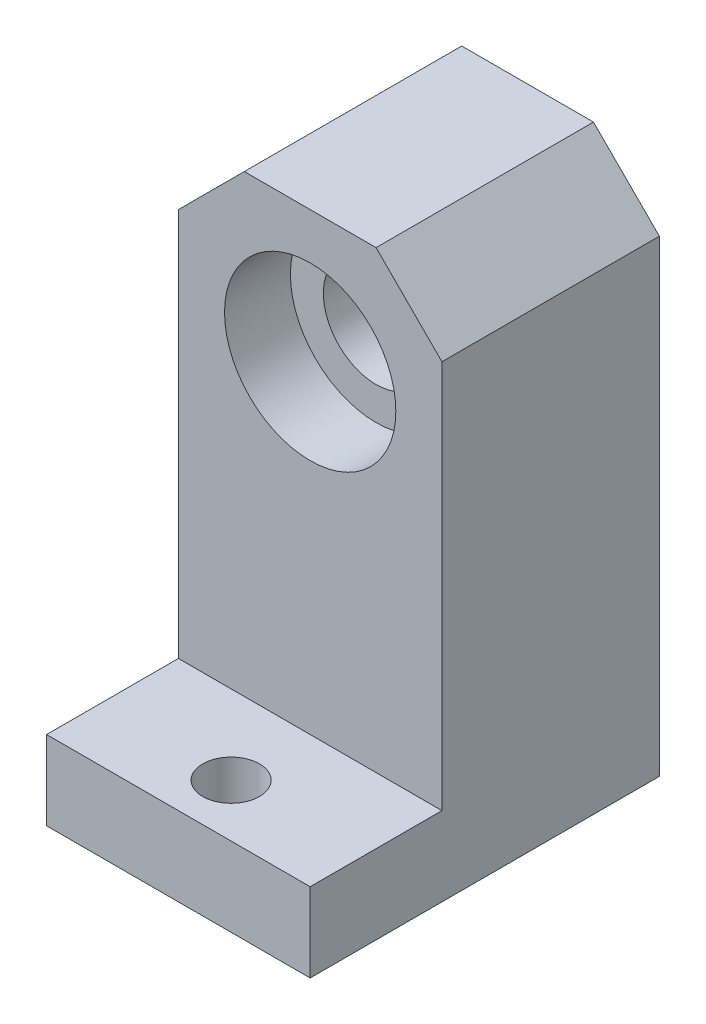
ISO-10303-21;
HEADER;
FILE_DESCRIPTION(('STEP AP214'),'2;1');
FILE_NAME('part.step','',(''),(''),'','','');
FILE_SCHEMA(('AUTOMOTIVE_DESIGN { 1 0 10303 214 1 1 1 1 }'));
ENDSEC;
DATA;
#1=APPLICATION_CONTEXT('core data for automotive mechanical design processes');
#2=APPLICATION_PROTOCOL_DEFINITION('international standard','automotive_design',2000,#1);
#3=PRODUCT_CONTEXT('',#1,'mechanical');
#4=PRODUCT('Part','Part','',(#3));
#5=PRODUCT_RELATED_PRODUCT_CATEGORY('part','',(#4));
#6=PRODUCT_DEFINITION_FORMATION('','',#4);
#7=PRODUCT_DEFINITION_CONTEXT('part definition',#1,'design');
#8=PRODUCT_DEFINITION('design','',#6,#7);
#9=PRODUCT_DEFINITION_SHAPE('','',#8);
#10=(LENGTH_UNIT() NAMED_UNIT(*) SI_UNIT(.MILLI.,.METRE.));
#11=(NAMED_UNIT(*) PLANE_ANGLE_UNIT() SI_UNIT($,.RADIAN.));
#12=(NAMED_UNIT(*) SI_UNIT($,.STERADIAN.) SOLID_ANGLE_UNIT());
#13=UNCERTAINTY_MEASURE_WITH_UNIT(LENGTH_MEASURE(1.E-05),#10,'distance_accuracy_value','');
#14=(GEOMETRIC_REPRESENTATION_CONTEXT(3) GLOBAL_UNCERTAINTY_ASSIGNED_CONTEXT((#13)) GLOBAL_UNIT_ASSIGNED_CONTEXT((#10,
#11,#12)) REPRESENTATION_CONTEXT('',''));
#15=CARTESIAN_POINT('',(0.,0.,0.));
#16=DIRECTION('',(0.,0.,1.));
#17=DIRECTION('',(1.,0.,0.));
#18=AXIS2_PLACEMENT_3D('',#15,#16,#17);
#19=CARTESIAN_POINT('',(0.,30.5,-8.25));
#20=DIRECTION('',(0.,0.,1.));
#21=DIRECTION('',(1.,0.,0.));
#22=AXIS2_PLACEMENT_3D('',#19,#20,#21);
#23=CYLINDRICAL_SURFACE('',#22,4.);
#24=CARTESIAN_POINT('',(0.,30.5,3.25));
#25=DIRECTION('',(0.,0.,1.));
#26=DIRECTION('',(1.,0.,0.));
#27=AXIS2_PLACEMENT_3D('',#24,#25,#26);
#28=CIRCLE('',#27,4.);
#29=CARTESIAN_POINT('',(4.,30.5,3.25));
#30=VERTEX_POINT('',#29);
#31=EDGE_CURVE('E137',#30,#30,#28,.F.);
#32=ORIENTED_EDGE('',*,*,#31,.F.);
#33=EDGE_LOOP('',(#32));
#34=FACE_BOUND('',#33,.T.);
#35=CARTESIAN_POINT('',(0.,30.5,-3.25));
#36=DIRECTION('',(0.,0.,-1.));
#37=DIRECTION('',(-1.,0.,0.));
#38=AXIS2_PLACEMENT_3D('',#35,#36,#37);
#39=CIRCLE('',#38,4.);
#40=CARTESIAN_POINT('',(-4.,30.5,-3.25));
#41=VERTEX_POINT('',#40);
#42=EDGE_CURVE('E150',#41,#41,#39,.F.);
#43=ORIENTED_EDGE('',*,*,#42,.F.);
#44=EDGE_LOOP('',(#43));
#45=FACE_BOUND('',#44,.T.);
#46=ADVANCED_FACE('F40',(#34,#45),#23,.F.);
#47=CARTESIAN_POINT('',(10.,0.,8.25));
#48=DIRECTION('',(-1.,0.,0.));
#49=DIRECTION('',(0.,-1.,0.));
#50=AXIS2_PLACEMENT_3D('',#47,#48,#49);
#51=PLANE('',#50);
#52=DIRECTION('',(0.,1.,0.));
#53=VECTOR('',#52,1.);
#54=CARTESIAN_POINT('',(10.,0.,-8.25));
#55=LINE('',#54,#53);
#56=CARTESIAN_POINT('',(10.,0.,-8.25));
#57=VERTEX_POINT('',#56);
#58=CARTESIAN_POINT('',(10.,35.5,-8.25));
#59=VERTEX_POINT('',#58);
#60=EDGE_CURVE('E133',#57,#59,#55,.T.);
#61=ORIENTED_EDGE('',*,*,#60,.T.);
#62=DIRECTION('',(0.,0.,1.));
#63=VECTOR('',#62,1.);
#64=CARTESIAN_POINT('',(10.,35.5,8.25));
#65=LINE('',#64,#63);
#66=CARTESIAN_POINT('',(10.,35.5,8.25));
#67=VERTEX_POINT('',#66);
#68=EDGE_CURVE('E163',#59,#67,#65,.T.);
#69=ORIENTED_EDGE('',*,*,#68,.T.);
#70=DIRECTION('',(0.,1.,0.));
#71=VECTOR('',#70,1.);
#72=CARTESIAN_POINT('',(10.,0.,8.25));
#73=LINE('',#72,#71);
#74=CARTESIAN_POINT('',(10.,6.,8.25));
#75=VERTEX_POINT('',#74);
#76=EDGE_CURVE('E129',#75,#67,#73,.T.);
#77=ORIENTED_EDGE('',*,*,#76,.F.);
#78=DIRECTION('',(0.,0.,1.));
#79=VECTOR('',#78,1.);
#80=CARTESIAN_POINT('',(10.,6.,18.25));
#81=LINE('',#80,#79);
#82=CARTESIAN_POINT('',(10.,6.,18.25));
#83=VERTEX_POINT('',#82);
#84=EDGE_CURVE('E56',#75,#83,#81,.T.);
#85=ORIENTED_EDGE('',*,*,#84,.T.);
#86=DIRECTION('',(0.,-1.,0.));
#87=VECTOR('',#86,1.);
#88=CARTESIAN_POINT('',(10.,0.,18.25));
#89=LINE('',#88,#87);
#90=CARTESIAN_POINT('',(10.,0.,18.25));
#91=VERTEX_POINT('',#90);
#92=EDGE_CURVE('E120',#83,#91,#89,.T.);
#93=ORIENTED_EDGE('',*,*,#92,.T.);
#94=DIRECTION('',(0.,0.,-1.));
#95=VECTOR('',#94,1.);
#96=CARTESIAN_POINT('',(10.,0.,8.25));
#97=LINE('',#96,#95);
#98=EDGE_CURVE('E123',#91,#57,#97,.T.);
#99=ORIENTED_EDGE('',*,*,#98,.T.);
#100=EDGE_LOOP('',(#61,#69,#77,#85,#93,#99));
#101=FACE_BOUND('',#100,.T.);
#102=ADVANCED_FACE('F181',(#101),#51,.F.);
#103=CARTESIAN_POINT('',(-10.,40.5,8.25));
#104=DIRECTION('',(0.,-1.,0.));
#105=DIRECTION('',(0.,0.,-1.));
#106=AXIS2_PLACEMENT_3D('',#103,#104,#105);
#107=PLANE('',#106);
#108=DIRECTION('',(-1.,0.,0.));
#109=VECTOR('',#108,1.);
#110=CARTESIAN_POINT('',(-10.,40.5,8.25));
#111=LINE('',#110,#109);
#112=CARTESIAN_POINT('',(5.,40.5,8.25));
#113=VERTEX_POINT('',#112);
#114=CARTESIAN_POINT('',(-4.99999999999997,40.5,8.25));
#115=VERTEX_POINT('',#114);
#116=EDGE_CURVE('E124',#113,#115,#111,.T.);
#117=ORIENTED_EDGE('',*,*,#116,.F.);
#118=DIRECTION('',(0.,0.,-1.));
#119=VECTOR('',#118,1.);
#120=CARTESIAN_POINT('',(5.,40.5,8.25));
#121=LINE('',#120,#119);
#122=CARTESIAN_POINT('',(5.,40.5,-8.25));
#123=VERTEX_POINT('',#122);
#124=EDGE_CURVE('E156',#113,#123,#121,.T.);
#125=ORIENTED_EDGE('',*,*,#124,.T.);
#126=DIRECTION('',(-1.,0.,0.));
#127=VECTOR('',#126,1.);
#128=CARTESIAN_POINT('',(-10.,40.5,-8.25));
#129=LINE('',#128,#127);
#130=CARTESIAN_POINT('',(-4.99999999999997,40.5,-8.25));
#131=VERTEX_POINT('',#130);
#132=EDGE_CURVE('E136',#123,#131,#129,.T.);
#133=ORIENTED_EDGE('',*,*,#132,.T.);
#134=DIRECTION('',(0.,0.,1.));
#135=VECTOR('',#134,1.);
#136=CARTESIAN_POINT('',(-4.99999999999997,40.5,8.25));
#137=LINE('',#136,#135);
#138=EDGE_CURVE('E146',#131,#115,#137,.T.);
#139=ORIENTED_EDGE('',*,*,#138,.T.);
#140=EDGE_LOOP('',(#117,#125,#133,#139));
#141=FACE_BOUND('',#140,.T.);
#142=ADVANCED_FACE('F172',(#141),#107,.F.);
#143=CARTESIAN_POINT('',(-10.,0.,8.25));
#144=DIRECTION('',(1.,0.,0.));
#145=DIRECTION('',(0.,1.,0.));
#146=AXIS2_PLACEMENT_3D('',#143,#144,#145);
#147=PLANE('',#146);
#148=DIRECTION('',(0.,-1.,0.));
#149=VECTOR('',#148,1.);
#150=CARTESIAN_POINT('',(-10.,0.,8.25));
#151=LINE('',#150,#149);
#152=CARTESIAN_POINT('',(-10.,35.5,8.25));
#153=VERTEX_POINT('',#152);
#154=CARTESIAN_POINT('',(-10.,6.,8.25));
#155=VERTEX_POINT('',#154);
#156=EDGE_CURVE('E117',#153,#155,#151,.T.);
#157=ORIENTED_EDGE('',*,*,#156,.F.);
#158=DIRECTION('',(0.,0.,-1.));
#159=VECTOR('',#158,1.);
#160=CARTESIAN_POINT('',(-10.,35.5,8.25));
#161=LINE('',#160,#159);
#162=CARTESIAN_POINT('',(-10.,35.5,-8.25));
#163=VERTEX_POINT('',#162);
#164=EDGE_CURVE('E11',#153,#163,#161,.T.);
#165=ORIENTED_EDGE('',*,*,#164,.T.);
#166=DIRECTION('',(0.,-1.,0.));
#167=VECTOR('',#166,1.);
#168=CARTESIAN_POINT('',(-10.,0.,-8.25));
#169=LINE('',#168,#167);
#170=CARTESIAN_POINT('',(-10.,0.,-8.25));
#171=VERTEX_POINT('',#170);
#172=EDGE_CURVE('E140',#163,#171,#169,.T.);
#173=ORIENTED_EDGE('',*,*,#172,.T.);
#174=DIRECTION('',(0.,0.,-1.));
#175=VECTOR('',#174,1.);
#176=CARTESIAN_POINT('',(-10.,0.,8.25));
#177=LINE('',#176,#175);
#178=CARTESIAN_POINT('',(-10.,0.,18.25));
#179=VERTEX_POINT('',#178);
#180=EDGE_CURVE('E127',#179,#171,#177,.T.);
#181=ORIENTED_EDGE('',*,*,#180,.F.);
#182=DIRECTION('',(0.,-1.,0.));
#183=VECTOR('',#182,1.);
#184=CARTESIAN_POINT('',(-10.,0.,18.25));
#185=LINE('',#184,#183);
#186=CARTESIAN_POINT('',(-10.,6.,18.25));
#187=VERTEX_POINT('',#186);
#188=EDGE_CURVE('E112',#187,#179,#185,.T.);
#189=ORIENTED_EDGE('',*,*,#188,.F.);
#190=DIRECTION('',(0.,0.,1.));
#191=VECTOR('',#190,1.);
#192=CARTESIAN_POINT('',(-10.,6.,18.25));
#193=LINE('',#192,#191);
#194=EDGE_CURVE('E109',#155,#187,#193,.T.);
#195=ORIENTED_EDGE('',*,*,#194,.F.);
#196=EDGE_LOOP('',(#157,#165,#173,#181,#189,#195));
#197=FACE_BOUND('',#196,.T.);
#198=ADVANCED_FACE('F116',(#197),#147,.F.);
#199=CARTESIAN_POINT('',(-10.,0.,8.25));
#200=DIRECTION('',(0.,1.,0.));
#201=DIRECTION('',(-1.,0.,0.));
#202=AXIS2_PLACEMENT_3D('',#199,#200,#201);
#203=PLANE('',#202);
#204=CARTESIAN_POINT('',(0.,0.,14.25));
#205=DIRECTION('',(0.,1.,0.));
#206=DIRECTION('',(-1.,0.,0.));
#207=AXIS2_PLACEMENT_3D('',#204,#205,#206);
#208=CIRCLE('',#207,2.15);
#209=CARTESIAN_POINT('',(-2.15,0.,14.25));
#210=VERTEX_POINT('',#209);
#211=EDGE_CURVE('E259',#210,#210,#208,.T.);
#212=ORIENTED_EDGE('',*,*,#211,.T.);
#213=EDGE_LOOP('',(#212));
#214=FACE_BOUND('',#213,.T.);
#215=DIRECTION('',(1.,0.,0.));
#216=VECTOR('',#215,1.);
#217=CARTESIAN_POINT('',(-10.,0.,-8.25));
#218=LINE('',#217,#216);
#219=EDGE_CURVE('E142',#171,#57,#218,.T.);
#220=ORIENTED_EDGE('',*,*,#219,.T.);
#221=ORIENTED_EDGE('',*,*,#98,.F.);
#222=DIRECTION('',(1.,0.,0.));
#223=VECTOR('',#222,1.);
#224=CARTESIAN_POINT('',(-10.,0.,18.25));
#225=LINE('',#224,#223);
#226=EDGE_CURVE('E188',#179,#91,#225,.T.);
#227=ORIENTED_EDGE('',*,*,#226,.F.);
#228=ORIENTED_EDGE('',*,*,#180,.T.);
#229=EDGE_LOOP('',(#220,#221,#227,#228));
#230=FACE_BOUND('',#229,.T.);
#231=ADVANCED_FACE('F187',(#214,#230),#203,.F.);
#232=CARTESIAN_POINT('',(0.,0.,8.25));
#233=DIRECTION('',(0.,0.,-1.));
#234=DIRECTION('',(-1.,0.,0.));
#235=AXIS2_PLACEMENT_3D('',#232,#233,#234);
#236=PLANE('',#235);
#237=CARTESIAN_POINT('',(0.,30.5,8.25));
#238=DIRECTION('',(0.,0.,1.));
#239=DIRECTION('',(1.,0.,0.));
#240=AXIS2_PLACEMENT_3D('',#237,#238,#239);
#241=CIRCLE('',#240,6.5);
#242=CARTESIAN_POINT('',(6.5,30.5,8.25));
#243=VERTEX_POINT('',#242);
#244=EDGE_CURVE('E153',#243,#243,#241,.T.);
#245=ORIENTED_EDGE('',*,*,#244,.F.);
#246=EDGE_LOOP('',(#245));
#247=FACE_BOUND('',#246,.T.);
#248=ORIENTED_EDGE('',*,*,#156,.T.);
#249=DIRECTION('',(1.,0.,0.));
#250=VECTOR('',#249,1.);
#251=CARTESIAN_POINT('',(-10.,6.,8.25));
#252=LINE('',#251,#250);
#253=EDGE_CURVE('E106',#155,#75,#252,.T.);
#254=ORIENTED_EDGE('',*,*,#253,.T.);
#255=ORIENTED_EDGE('',*,*,#76,.T.);
#256=DIRECTION('',(0.707106781186547,-0.707106781186549,0.));
#257=VECTOR('',#256,1.);
#258=CARTESIAN_POINT('',(5.,40.5,8.25));
#259=LINE('',#258,#257);
#260=EDGE_CURVE('E49',#67,#113,#259,.F.);
#261=ORIENTED_EDGE('',*,*,#260,.T.);
#262=ORIENTED_EDGE('',*,*,#116,.T.);
#263=DIRECTION('',(0.707106781186549,0.707106781186546,0.));
#264=VECTOR('',#263,1.);
#265=CARTESIAN_POINT('',(-10.,35.5,8.25));
#266=LINE('',#265,#264);
#267=EDGE_CURVE('E64',#115,#153,#266,.F.);
#268=ORIENTED_EDGE('',*,*,#267,.T.);
#269=EDGE_LOOP('',(#248,#254,#255,#261,#262,#268));
#270=FACE_BOUND('',#269,.T.);
#271=ADVANCED_FACE('F122',(#247,#270),#236,.F.);
#272=CARTESIAN_POINT('',(0.,0.,-8.25));
#273=DIRECTION('',(0.,0.,-1.));
#274=DIRECTION('',(-1.,0.,0.));
#275=AXIS2_PLACEMENT_3D('',#272,#273,#274);
#276=PLANE('',#275);
#277=CARTESIAN_POINT('',(0.,30.5,-8.25));
#278=DIRECTION('',(0.,0.,1.));
#279=DIRECTION('',(1.,0.,0.));
#280=AXIS2_PLACEMENT_3D('',#277,#278,#279);
#281=CIRCLE('',#280,6.5);
#282=CARTESIAN_POINT('',(6.5,30.5,-8.25));
#283=VERTEX_POINT('',#282);
#284=EDGE_CURVE('E191',#283,#283,#281,.T.);
#285=ORIENTED_EDGE('',*,*,#284,.T.);
#286=EDGE_LOOP('',(#285));
#287=FACE_BOUND('',#286,.T.);
#288=ORIENTED_EDGE('',*,*,#132,.F.);
#289=DIRECTION('',(-0.707106781186547,0.707106781186549,0.));
#290=VECTOR('',#289,1.);
#291=CARTESIAN_POINT('',(22.75,22.7499999999999,-8.25));
#292=LINE('',#291,#290);
#293=EDGE_CURVE('E161',#123,#59,#292,.F.);
#294=ORIENTED_EDGE('',*,*,#293,.T.);
#295=ORIENTED_EDGE('',*,*,#60,.F.);
#296=ORIENTED_EDGE('',*,*,#219,.F.);
#297=ORIENTED_EDGE('',*,*,#172,.F.);
#298=DIRECTION('',(-0.707106781186549,-0.707106781186546,0.));
#299=VECTOR('',#298,1.);
#300=CARTESIAN_POINT('',(-22.75,22.7500000000001,-8.25));
#301=LINE('',#300,#299);
#302=EDGE_CURVE('E159',#163,#131,#301,.F.);
#303=ORIENTED_EDGE('',*,*,#302,.T.);
#304=EDGE_LOOP('',(#288,#294,#295,#296,#297,#303));
#305=FACE_BOUND('',#304,.T.);
#306=ADVANCED_FACE('F178',(#287,#305),#276,.T.);
#307=CARTESIAN_POINT('',(0.,30.5,3.25));
#308=DIRECTION('',(0.,0.,1.));
#309=DIRECTION('',(1.,0.,0.));
#310=AXIS2_PLACEMENT_3D('',#307,#308,#309);
#311=PLANE('',#310);
#312=CARTESIAN_POINT('',(0.,30.5,3.25));
#313=DIRECTION('',(0.,0.,1.));
#314=DIRECTION('',(1.,0.,0.));
#315=AXIS2_PLACEMENT_3D('',#312,#313,#314);
#316=CIRCLE('',#315,6.5);
#317=CARTESIAN_POINT('',(6.5,30.5,3.25));
#318=VERTEX_POINT('',#317);
#319=EDGE_CURVE('E149',#318,#318,#316,.T.);
#320=ORIENTED_EDGE('',*,*,#319,.T.);
#321=EDGE_LOOP('',(#320));
#322=FACE_BOUND('',#321,.T.);
#323=ORIENTED_EDGE('',*,*,#31,.T.);
#324=EDGE_LOOP('',(#323));
#325=FACE_BOUND('',#324,.T.);
#326=ADVANCED_FACE('F214',(#322,#325),#311,.T.);
#327=CARTESIAN_POINT('',(0.,30.5,3.25));
#328=DIRECTION('',(0.,0.,1.));
#329=DIRECTION('',(1.,0.,0.));
#330=AXIS2_PLACEMENT_3D('',#327,#328,#329);
#331=CYLINDRICAL_SURFACE('',#330,6.5);
#332=ORIENTED_EDGE('',*,*,#319,.F.);
#333=EDGE_LOOP('',(#332));
#334=FACE_BOUND('',#333,.T.);
#335=ORIENTED_EDGE('',*,*,#244,.T.);
#336=EDGE_LOOP('',(#335));
#337=FACE_BOUND('',#336,.T.);
#338=ADVANCED_FACE('F206',(#334,#337),#331,.F.);
#339=CARTESIAN_POINT('',(0.,30.5,-3.25));
#340=DIRECTION('',(0.,0.,-1.));
#341=DIRECTION('',(1.,0.,0.));
#342=AXIS2_PLACEMENT_3D('',#339,#340,#341);
#343=PLANE('',#342);
#344=CARTESIAN_POINT('',(0.,30.5,-3.25));
#345=DIRECTION('',(0.,0.,1.));
#346=DIRECTION('',(1.,0.,0.));
#347=AXIS2_PLACEMENT_3D('',#344,#345,#346);
#348=CIRCLE('',#347,6.5);
#349=CARTESIAN_POINT('',(6.5,30.5,-3.25));
#350=VERTEX_POINT('',#349);
#351=EDGE_CURVE('E154',#350,#350,#348,.T.);
#352=ORIENTED_EDGE('',*,*,#351,.F.);
#353=EDGE_LOOP('',(#352));
#354=FACE_BOUND('',#353,.T.);
#355=ORIENTED_EDGE('',*,*,#42,.T.);
#356=EDGE_LOOP('',(#355));
#357=FACE_BOUND('',#356,.T.);
#358=ADVANCED_FACE('F231',(#354,#357),#343,.T.);
#359=CARTESIAN_POINT('',(0.,30.5,-3.25));
#360=DIRECTION('',(0.,0.,-1.));
#361=DIRECTION('',(-1.,0.,0.));
#362=AXIS2_PLACEMENT_3D('',#359,#360,#361);
#363=CYLINDRICAL_SURFACE('',#362,6.5);
#364=ORIENTED_EDGE('',*,*,#351,.T.);
#365=EDGE_LOOP('',(#364));
#366=FACE_BOUND('',#365,.T.);
#367=ORIENTED_EDGE('',*,*,#284,.F.);
#368=EDGE_LOOP('',(#367));
#369=FACE_BOUND('',#368,.T.);
#370=ADVANCED_FACE('F236',(#366,#369),#363,.F.);
#371=CARTESIAN_POINT('',(5.,40.5,8.25));
#372=DIRECTION('',(-0.707106781186549,-0.707106781186547,0.));
#373=DIRECTION('',(0.,0.,-1.));
#374=AXIS2_PLACEMENT_3D('',#371,#372,#373);
#375=PLANE('',#374);
#376=ORIENTED_EDGE('',*,*,#260,.F.);
#377=ORIENTED_EDGE('',*,*,#68,.F.);
#378=ORIENTED_EDGE('',*,*,#293,.F.);
#379=ORIENTED_EDGE('',*,*,#124,.F.);
#380=EDGE_LOOP('',(#376,#377,#378,#379));
#381=FACE_BOUND('',#380,.T.);
#382=ADVANCED_FACE('F175',(#381),#375,.F.);
#383=CARTESIAN_POINT('',(-10.,35.5,8.25));
#384=DIRECTION('',(0.707106781186546,-0.707106781186549,0.));
#385=DIRECTION('',(0.,0.,-1.));
#386=AXIS2_PLACEMENT_3D('',#383,#384,#385);
#387=PLANE('',#386);
#388=ORIENTED_EDGE('',*,*,#267,.F.);
#389=ORIENTED_EDGE('',*,*,#138,.F.);
#390=ORIENTED_EDGE('',*,*,#302,.F.);
#391=ORIENTED_EDGE('',*,*,#164,.F.);
#392=EDGE_LOOP('',(#388,#389,#390,#391));
#393=FACE_BOUND('',#392,.T.);
#394=ADVANCED_FACE('F43',(#393),#387,.F.);
#395=CARTESIAN_POINT('',(-10.,0.,18.25));
#396=DIRECTION('',(0.,0.,1.));
#397=DIRECTION('',(1.,0.,0.));
#398=AXIS2_PLACEMENT_3D('',#395,#396,#397);
#399=PLANE('',#398);
#400=ORIENTED_EDGE('',*,*,#92,.F.);
#401=DIRECTION('',(1.,0.,0.));
#402=VECTOR('',#401,1.);
#403=CARTESIAN_POINT('',(-10.,6.,18.25));
#404=LINE('',#403,#402);
#405=EDGE_CURVE('E111',#187,#83,#404,.T.);
#406=ORIENTED_EDGE('',*,*,#405,.F.);
#407=ORIENTED_EDGE('',*,*,#188,.T.);
#408=ORIENTED_EDGE('',*,*,#226,.T.);
#409=EDGE_LOOP('',(#400,#406,#407,#408));
#410=FACE_BOUND('',#409,.T.);
#411=ADVANCED_FACE('F190',(#410),#399,.T.);
#412=CARTESIAN_POINT('',(-10.,6.,18.25));
#413=DIRECTION('',(0.,1.,0.));
#414=DIRECTION('',(-1.,0.,0.));
#415=AXIS2_PLACEMENT_3D('',#412,#413,#414);
#416=PLANE('',#415);
#417=CARTESIAN_POINT('',(0.,6.,14.25));
#418=DIRECTION('',(0.,1.,0.));
#419=DIRECTION('',(-1.,0.,0.));
#420=AXIS2_PLACEMENT_3D('',#417,#418,#419);
#421=CIRCLE('',#420,2.15);
#422=CARTESIAN_POINT('',(-2.15,6.,14.25));
#423=VERTEX_POINT('',#422);
#424=EDGE_CURVE('E256',#423,#423,#421,.T.);
#425=ORIENTED_EDGE('',*,*,#424,.F.);
#426=EDGE_LOOP('',(#425));
#427=FACE_BOUND('',#426,.T.);
#428=ORIENTED_EDGE('',*,*,#84,.F.);
#429=ORIENTED_EDGE('',*,*,#253,.F.);
#430=ORIENTED_EDGE('',*,*,#194,.T.);
#431=ORIENTED_EDGE('',*,*,#405,.T.);
#432=EDGE_LOOP('',(#428,#429,#430,#431));
#433=FACE_BOUND('',#432,.T.);
#434=ADVANCED_FACE('F108',(#427,#433),#416,.T.);
#435=CARTESIAN_POINT('',(0.,-11.,14.25));
#436=DIRECTION('',(0.,1.,0.));
#437=DIRECTION('',(-1.,0.,0.));
#438=AXIS2_PLACEMENT_3D('',#435,#436,#437);
#439=CYLINDRICAL_SURFACE('',#438,2.15);
#440=ORIENTED_EDGE('',*,*,#424,.T.);
#441=EDGE_LOOP('',(#440));
#442=FACE_BOUND('',#441,.T.);
#443=ORIENTED_EDGE('',*,*,#211,.F.);
#444=EDGE_LOOP('',(#443));
#445=FACE_BOUND('',#444,.T.);
#446=ADVANCED_FACE('F245',(#442,#445),#439,.F.);
#447=CLOSED_SHELL('',(#46,#102,#142,#198,#231,#271,#306,#326,#338,#358,#370,#382,#394,#411,#434,#446));
#448=MANIFOLD_SOLID_BREP('B2',#447);
#449=ADVANCED_BREP_SHAPE_REPRESENTATION('',(#18,#448),#14);
#450=SHAPE_DEFINITION_REPRESENTATION(#9,#449);
ENDSEC;
END-ISO-10303-21;
